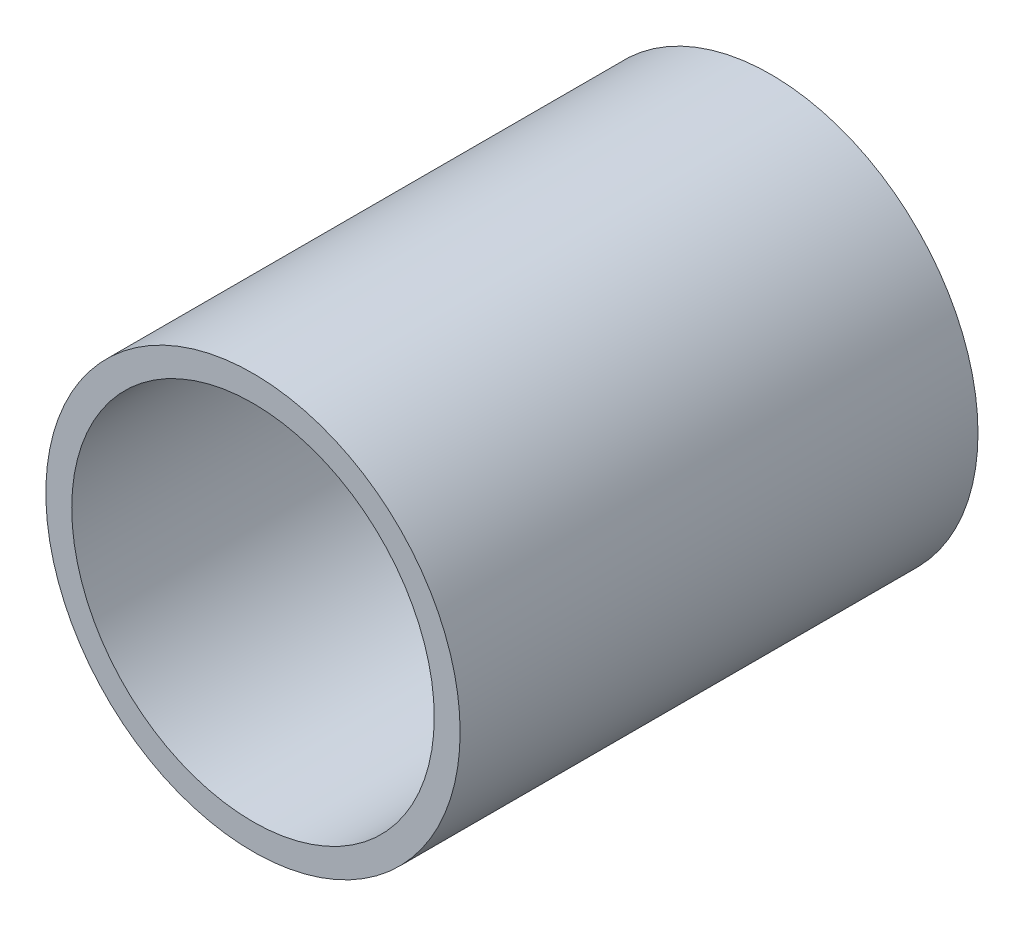
ISO-10303-21;
HEADER;
FILE_DESCRIPTION(('STEP AP214'),'2;1');
FILE_NAME('part.step','',(''),(''),'','','');
FILE_SCHEMA(('AUTOMOTIVE_DESIGN { 1 0 10303 214 1 1 1 1 }'));
ENDSEC;
DATA;
#1=APPLICATION_CONTEXT('core data for automotive mechanical design processes');
#2=APPLICATION_PROTOCOL_DEFINITION('international standard','automotive_design',2000,#1);
#3=PRODUCT_CONTEXT('',#1,'mechanical');
#4=PRODUCT('Part','Part','',(#3));
#5=PRODUCT_RELATED_PRODUCT_CATEGORY('part','',(#4));
#6=PRODUCT_DEFINITION_FORMATION('','',#4);
#7=PRODUCT_DEFINITION_CONTEXT('part definition',#1,'design');
#8=PRODUCT_DEFINITION('design','',#6,#7);
#9=PRODUCT_DEFINITION_SHAPE('','',#8);
#10=(LENGTH_UNIT() NAMED_UNIT(*) SI_UNIT(.MILLI.,.METRE.));
#11=(NAMED_UNIT(*) PLANE_ANGLE_UNIT() SI_UNIT($,.RADIAN.));
#12=(NAMED_UNIT(*) SI_UNIT($,.STERADIAN.) SOLID_ANGLE_UNIT());
#13=UNCERTAINTY_MEASURE_WITH_UNIT(LENGTH_MEASURE(1.E-05),#10,'distance_accuracy_value','');
#14=(GEOMETRIC_REPRESENTATION_CONTEXT(3) GLOBAL_UNCERTAINTY_ASSIGNED_CONTEXT((#13)) GLOBAL_UNIT_ASSIGNED_CONTEXT((#10,
#11,#12)) REPRESENTATION_CONTEXT('',''));
#15=CARTESIAN_POINT('',(0.,0.,0.));
#16=DIRECTION('',(0.,0.,1.));
#17=DIRECTION('',(1.,0.,0.));
#18=AXIS2_PLACEMENT_3D('',#15,#16,#17);
#19=CARTESIAN_POINT('',(0.,0.,10.));
#20=DIRECTION('',(0.,0.,1.));
#21=DIRECTION('',(1.,0.,0.));
#22=AXIS2_PLACEMENT_3D('',#19,#20,#21);
#23=PLANE('',#22);
#24=CARTESIAN_POINT('',(0.,0.,10.));
#25=DIRECTION('',(0.,0.,1.));
#26=DIRECTION('',(1.,0.,0.));
#27=AXIS2_PLACEMENT_3D('',#24,#25,#26);
#28=CIRCLE('',#27,4.);
#29=CARTESIAN_POINT('',(4.,0.,10.));
#30=VERTEX_POINT('',#29);
#31=EDGE_CURVE('E10',#30,#30,#28,.T.);
#32=ORIENTED_EDGE('',*,*,#31,.T.);
#33=EDGE_LOOP('',(#32));
#34=FACE_BOUND('',#33,.T.);
#35=CARTESIAN_POINT('',(0.,0.,10.));
#36=DIRECTION('',(0.,0.,1.));
#37=DIRECTION('',(1.,0.,0.));
#38=AXIS2_PLACEMENT_3D('',#35,#36,#37);
#39=CIRCLE('',#38,3.5);
#40=CARTESIAN_POINT('',(3.5,0.,10.));
#41=VERTEX_POINT('',#40);
#42=EDGE_CURVE('E40',#41,#41,#39,.T.);
#43=ORIENTED_EDGE('',*,*,#42,.F.);
#44=EDGE_LOOP('',(#43));
#45=FACE_BOUND('',#44,.T.);
#46=ADVANCED_FACE('F29',(#34,#45),#23,.T.);
#47=CARTESIAN_POINT('',(0.,0.,0.));
#48=DIRECTION('',(0.,0.,1.));
#49=DIRECTION('',(1.,0.,0.));
#50=AXIS2_PLACEMENT_3D('',#47,#48,#49);
#51=PLANE('',#50);
#52=CARTESIAN_POINT('',(0.,0.,0.));
#53=DIRECTION('',(0.,0.,1.));
#54=DIRECTION('',(1.,0.,0.));
#55=AXIS2_PLACEMENT_3D('',#52,#53,#54);
#56=CIRCLE('',#55,4.);
#57=CARTESIAN_POINT('',(4.,0.,0.));
#58=VERTEX_POINT('',#57);
#59=EDGE_CURVE('E36',#58,#58,#56,.T.);
#60=ORIENTED_EDGE('',*,*,#59,.F.);
#61=EDGE_LOOP('',(#60));
#62=FACE_BOUND('',#61,.T.);
#63=CARTESIAN_POINT('',(0.,0.,0.));
#64=DIRECTION('',(0.,0.,1.));
#65=DIRECTION('',(1.,0.,0.));
#66=AXIS2_PLACEMENT_3D('',#63,#64,#65);
#67=CIRCLE('',#66,3.5);
#68=CARTESIAN_POINT('',(3.5,0.,0.));
#69=VERTEX_POINT('',#68);
#70=EDGE_CURVE('E44',#69,#69,#67,.T.);
#71=ORIENTED_EDGE('',*,*,#70,.T.);
#72=EDGE_LOOP('',(#71));
#73=FACE_BOUND('',#72,.T.);
#74=ADVANCED_FACE('F50',(#62,#73),#51,.F.);
#75=CARTESIAN_POINT('',(0.,0.,10.));
#76=DIRECTION('',(0.,0.,-1.));
#77=DIRECTION('',(-1.,0.,0.));
#78=AXIS2_PLACEMENT_3D('',#75,#76,#77);
#79=CYLINDRICAL_SURFACE('',#78,4.);
#80=ORIENTED_EDGE('',*,*,#31,.F.);
#81=EDGE_LOOP('',(#80));
#82=FACE_BOUND('',#81,.T.);
#83=ORIENTED_EDGE('',*,*,#59,.T.);
#84=EDGE_LOOP('',(#83));
#85=FACE_BOUND('',#84,.T.);
#86=ADVANCED_FACE('F31',(#82,#85),#79,.T.);
#87=CARTESIAN_POINT('',(0.,0.,10.));
#88=DIRECTION('',(0.,0.,-1.));
#89=DIRECTION('',(-1.,0.,0.));
#90=AXIS2_PLACEMENT_3D('',#87,#88,#89);
#91=CYLINDRICAL_SURFACE('',#90,3.5);
#92=ORIENTED_EDGE('',*,*,#42,.T.);
#93=EDGE_LOOP('',(#92));
#94=FACE_BOUND('',#93,.T.);
#95=ORIENTED_EDGE('',*,*,#70,.F.);
#96=EDGE_LOOP('',(#95));
#97=FACE_BOUND('',#96,.T.);
#98=ADVANCED_FACE('F52',(#94,#97),#91,.F.);
#99=CLOSED_SHELL('',(#46,#74,#86,#98));
#100=MANIFOLD_SOLID_BREP('B2',#99);
#101=ADVANCED_BREP_SHAPE_REPRESENTATION('',(#18,#100),#14);
#102=SHAPE_DEFINITION_REPRESENTATION(#9,#101);
ENDSEC;
END-ISO-10303-21;
